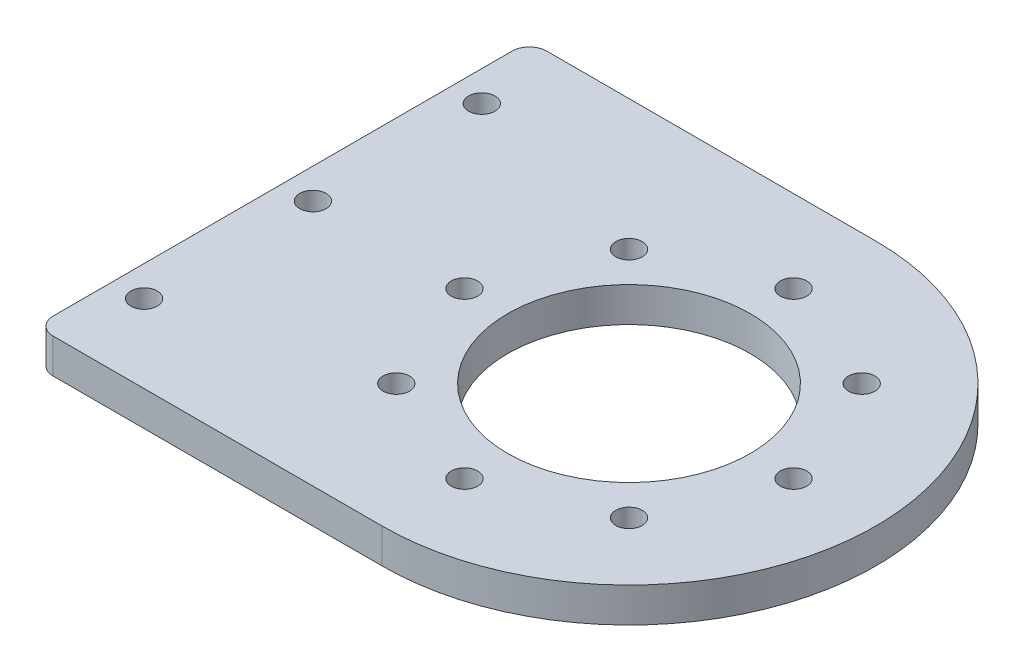
ISO-10303-21;
HEADER;
FILE_DESCRIPTION(('STEP AP214'),'2;1');
FILE_NAME('part.step','',(''),(''),'','','');
FILE_SCHEMA(('AUTOMOTIVE_DESIGN { 1 0 10303 214 1 1 1 1 }'));
ENDSEC;
DATA;
#1=APPLICATION_CONTEXT('core data for automotive mechanical design processes');
#2=APPLICATION_PROTOCOL_DEFINITION('international standard','automotive_design',2000,#1);
#3=PRODUCT_CONTEXT('',#1,'mechanical');
#4=PRODUCT('Part','Part','',(#3));
#5=PRODUCT_RELATED_PRODUCT_CATEGORY('part','',(#4));
#6=PRODUCT_DEFINITION_FORMATION('','',#4);
#7=PRODUCT_DEFINITION_CONTEXT('part definition',#1,'design');
#8=PRODUCT_DEFINITION('design','',#6,#7);
#9=PRODUCT_DEFINITION_SHAPE('','',#8);
#10=(LENGTH_UNIT() NAMED_UNIT(*) SI_UNIT(.MILLI.,.METRE.));
#11=(NAMED_UNIT(*) PLANE_ANGLE_UNIT() SI_UNIT($,.RADIAN.));
#12=(NAMED_UNIT(*) SI_UNIT($,.STERADIAN.) SOLID_ANGLE_UNIT());
#13=UNCERTAINTY_MEASURE_WITH_UNIT(LENGTH_MEASURE(1.E-05),#10,'distance_accuracy_value','');
#14=(GEOMETRIC_REPRESENTATION_CONTEXT(3) GLOBAL_UNCERTAINTY_ASSIGNED_CONTEXT((#13)) GLOBAL_UNIT_ASSIGNED_CONTEXT((#10,
#11,#12)) REPRESENTATION_CONTEXT('',''));
#15=CARTESIAN_POINT('',(0.,0.,0.));
#16=DIRECTION('',(0.,0.,1.));
#17=DIRECTION('',(1.,0.,0.));
#18=AXIS2_PLACEMENT_3D('',#15,#16,#17);
#19=CARTESIAN_POINT('',(0.,4.,28.5));
#20=DIRECTION('',(0.,0.,-1.));
#21=DIRECTION('',(-1.,0.,0.));
#22=AXIS2_PLACEMENT_3D('',#19,#20,#21);
#23=PLANE('',#22);
#24=DIRECTION('',(1.,0.,0.));
#25=VECTOR('',#24,1.);
#26=CARTESIAN_POINT('',(0.,4.,28.5));
#27=LINE('',#26,#25);
#28=CARTESIAN_POINT('',(-18.5,4.,28.5));
#29=VERTEX_POINT('',#28);
#30=CARTESIAN_POINT('',(19.5,4.,28.5));
#31=VERTEX_POINT('',#30);
#32=EDGE_CURVE('E92',#29,#31,#27,.T.);
#33=ORIENTED_EDGE('',*,*,#32,.F.);
#34=DIRECTION('',(0.,1.,0.));
#35=VECTOR('',#34,1.);
#36=CARTESIAN_POINT('',(-18.5,0.,28.5));
#37=LINE('',#36,#35);
#38=CARTESIAN_POINT('',(-18.5,0.,28.5));
#39=VERTEX_POINT('',#38);
#40=EDGE_CURVE('E61',#29,#39,#37,.F.);
#41=ORIENTED_EDGE('',*,*,#40,.T.);
#42=DIRECTION('',(1.,0.,0.));
#43=VECTOR('',#42,1.);
#44=CARTESIAN_POINT('',(0.,0.,28.5));
#45=LINE('',#44,#43);
#46=CARTESIAN_POINT('',(19.5,0.,28.5));
#47=VERTEX_POINT('',#46);
#48=EDGE_CURVE('E112',#39,#47,#45,.T.);
#49=ORIENTED_EDGE('',*,*,#48,.T.);
#50=DIRECTION('',(0.,-1.,0.));
#51=VECTOR('',#50,1.);
#52=CARTESIAN_POINT('',(19.5,4.,28.5));
#53=LINE('',#52,#51);
#54=EDGE_CURVE('E107',#31,#47,#53,.T.);
#55=ORIENTED_EDGE('',*,*,#54,.F.);
#56=EDGE_LOOP('',(#33,#41,#49,#55));
#57=FACE_BOUND('',#56,.T.);
#58=ADVANCED_FACE('F38',(#57),#23,.F.);
#59=CARTESIAN_POINT('',(19.5,4.,0.));
#60=DIRECTION('',(0.,-1.,0.));
#61=DIRECTION('',(0.,0.,-1.));
#62=AXIS2_PLACEMENT_3D('',#59,#60,#61);
#63=CYLINDRICAL_SURFACE('',#62,28.5);
#64=CARTESIAN_POINT('',(19.5,0.,0.));
#65=DIRECTION('',(0.,1.,0.));
#66=DIRECTION('',(0.,0.,1.));
#67=AXIS2_PLACEMENT_3D('',#64,#65,#66);
#68=CIRCLE('',#67,28.5);
#69=CARTESIAN_POINT('',(19.5,0.,-28.5));
#70=VERTEX_POINT('',#69);
#71=EDGE_CURVE('E293',#47,#70,#68,.T.);
#72=ORIENTED_EDGE('',*,*,#71,.T.);
#73=DIRECTION('',(0.,-1.,0.));
#74=VECTOR('',#73,1.);
#75=CARTESIAN_POINT('',(19.5,4.,-28.5));
#76=LINE('',#75,#74);
#77=CARTESIAN_POINT('',(19.5,4.,-28.5));
#78=VERTEX_POINT('',#77);
#79=EDGE_CURVE('E109',#78,#70,#76,.T.);
#80=ORIENTED_EDGE('',*,*,#79,.F.);
#81=CARTESIAN_POINT('',(19.5,4.,0.));
#82=DIRECTION('',(0.,1.,0.));
#83=DIRECTION('',(0.,0.,1.));
#84=AXIS2_PLACEMENT_3D('',#81,#82,#83);
#85=CIRCLE('',#84,28.5);
#86=EDGE_CURVE('E97',#31,#78,#85,.T.);
#87=ORIENTED_EDGE('',*,*,#86,.F.);
#88=ORIENTED_EDGE('',*,*,#54,.T.);
#89=EDGE_LOOP('',(#72,#80,#87,#88));
#90=FACE_BOUND('',#89,.T.);
#91=ADVANCED_FACE('F106',(#90),#63,.T.);
#92=CARTESIAN_POINT('',(0.,4.,-28.5));
#93=DIRECTION('',(0.,0.,-1.));
#94=DIRECTION('',(-1.,0.,0.));
#95=AXIS2_PLACEMENT_3D('',#92,#93,#94);
#96=PLANE('',#95);
#97=DIRECTION('',(1.,0.,0.));
#98=VECTOR('',#97,1.);
#99=CARTESIAN_POINT('',(0.,0.,-28.5));
#100=LINE('',#99,#98);
#101=CARTESIAN_POINT('',(-18.5,0.,-28.5));
#102=VERTEX_POINT('',#101);
#103=EDGE_CURVE('E101',#102,#70,#100,.T.);
#104=ORIENTED_EDGE('',*,*,#103,.F.);
#105=DIRECTION('',(0.,1.,0.));
#106=VECTOR('',#105,1.);
#107=CARTESIAN_POINT('',(-18.5,4.,-28.5));
#108=LINE('',#107,#106);
#109=CARTESIAN_POINT('',(-18.5,4.,-28.5));
#110=VERTEX_POINT('',#109);
#111=EDGE_CURVE('E11',#102,#110,#108,.T.);
#112=ORIENTED_EDGE('',*,*,#111,.T.);
#113=DIRECTION('',(1.,0.,0.));
#114=VECTOR('',#113,1.);
#115=CARTESIAN_POINT('',(0.,4.,-28.5));
#116=LINE('',#115,#114);
#117=EDGE_CURVE('E110',#110,#78,#116,.T.);
#118=ORIENTED_EDGE('',*,*,#117,.T.);
#119=ORIENTED_EDGE('',*,*,#79,.T.);
#120=EDGE_LOOP('',(#104,#112,#118,#119));
#121=FACE_BOUND('',#120,.T.);
#122=ADVANCED_FACE('F154',(#121),#96,.T.);
#123=CARTESIAN_POINT('',(0.,4.,0.));
#124=DIRECTION('',(0.,1.,0.));
#125=DIRECTION('',(0.,0.,1.));
#126=AXIS2_PLACEMENT_3D('',#123,#124,#125);
#127=PLANE('',#126);
#128=CARTESIAN_POINT('',(-17.0000000000104,4.,-19.5));
#129=DIRECTION('',(0.,-1.,0.));
#130=DIRECTION('',(0.,0.,-1.));
#131=AXIS2_PLACEMENT_3D('',#128,#129,#130);
#132=CIRCLE('',#131,1.525);
#133=CARTESIAN_POINT('',(-17.0000000000104,4.,-21.025));
#134=VERTEX_POINT('',#133);
#135=EDGE_CURVE('E222',#134,#134,#132,.T.);
#136=ORIENTED_EDGE('',*,*,#135,.T.);
#137=EDGE_LOOP('',(#136));
#138=FACE_BOUND('',#137,.T.);
#139=CARTESIAN_POINT('',(-17.0000000000104,4.,19.5));
#140=DIRECTION('',(0.,-1.,0.));
#141=DIRECTION('',(0.,0.,-1.));
#142=AXIS2_PLACEMENT_3D('',#139,#140,#141);
#143=CIRCLE('',#142,1.525);
#144=CARTESIAN_POINT('',(-17.0000000000104,4.,17.975));
#145=VERTEX_POINT('',#144);
#146=EDGE_CURVE('E217',#145,#145,#143,.T.);
#147=ORIENTED_EDGE('',*,*,#146,.T.);
#148=EDGE_LOOP('',(#147));
#149=FACE_BOUND('',#148,.T.);
#150=CARTESIAN_POINT('',(-17.0000000000104,4.,0.));
#151=DIRECTION('',(0.,-1.,0.));
#152=DIRECTION('',(0.,0.,-1.));
#153=AXIS2_PLACEMENT_3D('',#150,#151,#152);
#154=CIRCLE('',#153,1.525);
#155=CARTESIAN_POINT('',(-17.0000000000104,4.,-1.52499999999997));
#156=VERTEX_POINT('',#155);
#157=EDGE_CURVE('E232',#156,#156,#154,.T.);
#158=ORIENTED_EDGE('',*,*,#157,.T.);
#159=EDGE_LOOP('',(#158));
#160=FACE_BOUND('',#159,.T.);
#161=CARTESIAN_POINT('',(19.5,4.,0.));
#162=DIRECTION('',(0.,1.,0.));
#163=DIRECTION('',(0.,0.,1.));
#164=AXIS2_PLACEMENT_3D('',#161,#162,#163);
#165=CIRCLE('',#164,14.);
#166=CARTESIAN_POINT('',(19.5,4.,14.));
#167=VERTEX_POINT('',#166);
#168=EDGE_CURVE('E235',#167,#167,#165,.T.);
#169=ORIENTED_EDGE('',*,*,#168,.F.);
#170=EDGE_LOOP('',(#169));
#171=FACE_BOUND('',#170,.T.);
#172=CARTESIAN_POINT('',(38.5,4.,0.));
#173=DIRECTION('',(0.,1.,0.));
#174=DIRECTION('',(0.,0.,1.));
#175=AXIS2_PLACEMENT_3D('',#172,#173,#174);
#176=CIRCLE('',#175,1.525);
#177=CARTESIAN_POINT('',(38.5,4.,1.525));
#178=VERTEX_POINT('',#177);
#179=EDGE_CURVE('E266',#178,#178,#176,.T.);
#180=ORIENTED_EDGE('',*,*,#179,.F.);
#181=EDGE_LOOP('',(#180));
#182=FACE_BOUND('',#181,.T.);
#183=CARTESIAN_POINT('',(32.9350288425443,4.,13.4350288425445));
#184=DIRECTION('',(0.,1.,0.));
#185=DIRECTION('',(0.,0.,1.));
#186=AXIS2_PLACEMENT_3D('',#183,#184,#185);
#187=CIRCLE('',#186,1.525);
#188=CARTESIAN_POINT('',(32.9350288425443,4.,14.9600288425445));
#189=VERTEX_POINT('',#188);
#190=EDGE_CURVE('E272',#189,#189,#187,.T.);
#191=ORIENTED_EDGE('',*,*,#190,.F.);
#192=EDGE_LOOP('',(#191));
#193=FACE_BOUND('',#192,.T.);
#194=CARTESIAN_POINT('',(6.06497115745552,4.,13.4350288425443));
#195=DIRECTION('',(0.,1.,0.));
#196=DIRECTION('',(0.,0.,1.));
#197=AXIS2_PLACEMENT_3D('',#194,#195,#196);
#198=CIRCLE('',#197,1.525);
#199=CARTESIAN_POINT('',(6.06497115745552,4.,14.9600288425443));
#200=VERTEX_POINT('',#199);
#201=EDGE_CURVE('E278',#200,#200,#198,.T.);
#202=ORIENTED_EDGE('',*,*,#201,.F.);
#203=EDGE_LOOP('',(#202));
#204=FACE_BOUND('',#203,.T.);
#205=CARTESIAN_POINT('',(6.06497115745565,4.,-13.4350288425445));
#206=DIRECTION('',(0.,1.,0.));
#207=DIRECTION('',(0.,0.,1.));
#208=AXIS2_PLACEMENT_3D('',#205,#206,#207);
#209=CIRCLE('',#208,1.525);
#210=CARTESIAN_POINT('',(6.06497115745565,4.,-11.9100288425445));
#211=VERTEX_POINT('',#210);
#212=EDGE_CURVE('E247',#211,#211,#209,.T.);
#213=ORIENTED_EDGE('',*,*,#212,.F.);
#214=EDGE_LOOP('',(#213));
#215=FACE_BOUND('',#214,.T.);
#216=CARTESIAN_POINT('',(19.4999999999999,4.,19.));
#217=DIRECTION('',(0.,1.,0.));
#218=DIRECTION('',(0.,0.,1.));
#219=AXIS2_PLACEMENT_3D('',#216,#217,#218);
#220=CIRCLE('',#219,1.52499999999999);
#221=CARTESIAN_POINT('',(19.4999999999999,4.,20.525));
#222=VERTEX_POINT('',#221);
#223=EDGE_CURVE('E248',#222,#222,#220,.T.);
#224=ORIENTED_EDGE('',*,*,#223,.F.);
#225=EDGE_LOOP('',(#224));
#226=FACE_BOUND('',#225,.T.);
#227=CARTESIAN_POINT('',(0.499999999999987,4.,-1.37329948712799E-13));
#228=DIRECTION('',(0.,1.,0.));
#229=DIRECTION('',(0.,0.,1.));
#230=AXIS2_PLACEMENT_3D('',#227,#228,#229);
#231=CIRCLE('',#230,1.52499999999999);
#232=CARTESIAN_POINT('',(0.499999999999987,4.,1.52499999999986));
#233=VERTEX_POINT('',#232);
#234=EDGE_CURVE('E254',#233,#233,#231,.T.);
#235=ORIENTED_EDGE('',*,*,#234,.F.);
#236=EDGE_LOOP('',(#235));
#237=FACE_BOUND('',#236,.T.);
#238=CARTESIAN_POINT('',(19.5000000000002,4.,-19.));
#239=DIRECTION('',(0.,1.,0.));
#240=DIRECTION('',(0.,0.,1.));
#241=AXIS2_PLACEMENT_3D('',#238,#239,#240);
#242=CIRCLE('',#241,1.525);
#243=CARTESIAN_POINT('',(19.5000000000002,4.,-17.475));
#244=VERTEX_POINT('',#243);
#245=EDGE_CURVE('E241',#244,#244,#242,.T.);
#246=ORIENTED_EDGE('',*,*,#245,.F.);
#247=EDGE_LOOP('',(#246));
#248=FACE_BOUND('',#247,.T.);
#249=CARTESIAN_POINT('',(32.9350288425445,4.,-13.4350288425443));
#250=DIRECTION('',(0.,1.,0.));
#251=DIRECTION('',(0.,0.,1.));
#252=AXIS2_PLACEMENT_3D('',#249,#250,#251);
#253=CIRCLE('',#252,1.525);
#254=CARTESIAN_POINT('',(32.9350288425445,4.,-11.9100288425443));
#255=VERTEX_POINT('',#254);
#256=EDGE_CURVE('E265',#255,#255,#253,.T.);
#257=ORIENTED_EDGE('',*,*,#256,.F.);
#258=EDGE_LOOP('',(#257));
#259=FACE_BOUND('',#258,.T.);
#260=DIRECTION('',(0.,0.,1.));
#261=VECTOR('',#260,1.);
#262=CARTESIAN_POINT('',(-20.5,4.,-28.5));
#263=LINE('',#262,#261);
#264=CARTESIAN_POINT('',(-20.5,4.,-26.5));
#265=VERTEX_POINT('',#264);
#266=CARTESIAN_POINT('',(-20.5,4.,26.5));
#267=VERTEX_POINT('',#266);
#268=EDGE_CURVE('E138',#265,#267,#263,.T.);
#269=ORIENTED_EDGE('',*,*,#268,.T.);
#270=CARTESIAN_POINT('',(-18.5,4.,26.5));
#271=DIRECTION('',(0.,1.,0.));
#272=DIRECTION('',(0.,0.,1.));
#273=AXIS2_PLACEMENT_3D('',#270,#271,#272);
#274=CIRCLE('',#273,2.);
#275=EDGE_CURVE('E99',#267,#29,#274,.T.);
#276=ORIENTED_EDGE('',*,*,#275,.T.);
#277=ORIENTED_EDGE('',*,*,#32,.T.);
#278=ORIENTED_EDGE('',*,*,#86,.T.);
#279=ORIENTED_EDGE('',*,*,#117,.F.);
#280=CARTESIAN_POINT('',(-18.5,4.,-26.5));
#281=DIRECTION('',(0.,1.,0.));
#282=DIRECTION('',(0.,0.,1.));
#283=AXIS2_PLACEMENT_3D('',#280,#281,#282);
#284=CIRCLE('',#283,2.);
#285=EDGE_CURVE('E123',#110,#265,#284,.T.);
#286=ORIENTED_EDGE('',*,*,#285,.T.);
#287=EDGE_LOOP('',(#269,#276,#277,#278,#279,#286));
#288=FACE_BOUND('',#287,.T.);
#289=ADVANCED_FACE('F95',(#138,#149,#160,#171,#182,#193,#204,#215,#226,#237,#248,#259,#288),
#127,.T.);
#290=CARTESIAN_POINT('',(0.,0.,0.));
#291=DIRECTION('',(0.,1.,0.));
#292=DIRECTION('',(0.,0.,1.));
#293=AXIS2_PLACEMENT_3D('',#290,#291,#292);
#294=PLANE('',#293);
#295=CARTESIAN_POINT('',(-17.0000000000104,0.,-19.5));
#296=DIRECTION('',(0.,-1.,0.));
#297=DIRECTION('',(0.,0.,-1.));
#298=AXIS2_PLACEMENT_3D('',#295,#296,#297);
#299=CIRCLE('',#298,1.525);
#300=CARTESIAN_POINT('',(-17.0000000000104,0.,-21.025));
#301=VERTEX_POINT('',#300);
#302=EDGE_CURVE('E137',#301,#301,#299,.T.);
#303=ORIENTED_EDGE('',*,*,#302,.F.);
#304=EDGE_LOOP('',(#303));
#305=FACE_BOUND('',#304,.T.);
#306=CARTESIAN_POINT('',(-17.0000000000104,0.,19.5));
#307=DIRECTION('',(0.,-1.,0.));
#308=DIRECTION('',(0.,0.,-1.));
#309=AXIS2_PLACEMENT_3D('',#306,#307,#308);
#310=CIRCLE('',#309,1.525);
#311=CARTESIAN_POINT('',(-17.0000000000104,0.,17.975));
#312=VERTEX_POINT('',#311);
#313=EDGE_CURVE('E220',#312,#312,#310,.T.);
#314=ORIENTED_EDGE('',*,*,#313,.F.);
#315=EDGE_LOOP('',(#314));
#316=FACE_BOUND('',#315,.T.);
#317=CARTESIAN_POINT('',(-17.0000000000104,0.,0.));
#318=DIRECTION('',(0.,-1.,0.));
#319=DIRECTION('',(0.,0.,-1.));
#320=AXIS2_PLACEMENT_3D('',#317,#318,#319);
#321=CIRCLE('',#320,1.525);
#322=CARTESIAN_POINT('',(-17.0000000000104,0.,-1.52499999999997));
#323=VERTEX_POINT('',#322);
#324=EDGE_CURVE('E224',#323,#323,#321,.T.);
#325=ORIENTED_EDGE('',*,*,#324,.F.);
#326=EDGE_LOOP('',(#325));
#327=FACE_BOUND('',#326,.T.);
#328=CARTESIAN_POINT('',(19.5,0.,0.));
#329=DIRECTION('',(0.,1.,0.));
#330=DIRECTION('',(0.,0.,1.));
#331=AXIS2_PLACEMENT_3D('',#328,#329,#330);
#332=CIRCLE('',#331,14.);
#333=CARTESIAN_POINT('',(19.5,0.,14.));
#334=VERTEX_POINT('',#333);
#335=EDGE_CURVE('E238',#334,#334,#332,.T.);
#336=ORIENTED_EDGE('',*,*,#335,.T.);
#337=EDGE_LOOP('',(#336));
#338=FACE_BOUND('',#337,.T.);
#339=CARTESIAN_POINT('',(38.5,0.,0.));
#340=DIRECTION('',(0.,1.,0.));
#341=DIRECTION('',(0.,0.,1.));
#342=AXIS2_PLACEMENT_3D('',#339,#340,#341);
#343=CIRCLE('',#342,1.525);
#344=CARTESIAN_POINT('',(38.5,0.,1.525));
#345=VERTEX_POINT('',#344);
#346=EDGE_CURVE('E262',#345,#345,#343,.T.);
#347=ORIENTED_EDGE('',*,*,#346,.T.);
#348=EDGE_LOOP('',(#347));
#349=FACE_BOUND('',#348,.T.);
#350=CARTESIAN_POINT('',(32.9350288425443,0.,13.4350288425445));
#351=DIRECTION('',(0.,1.,0.));
#352=DIRECTION('',(0.,0.,1.));
#353=AXIS2_PLACEMENT_3D('',#350,#351,#352);
#354=CIRCLE('',#353,1.525);
#355=CARTESIAN_POINT('',(32.9350288425443,0.,14.9600288425445));
#356=VERTEX_POINT('',#355);
#357=EDGE_CURVE('E269',#356,#356,#354,.T.);
#358=ORIENTED_EDGE('',*,*,#357,.T.);
#359=EDGE_LOOP('',(#358));
#360=FACE_BOUND('',#359,.T.);
#361=CARTESIAN_POINT('',(6.06497115745552,0.,13.4350288425443));
#362=DIRECTION('',(0.,1.,0.));
#363=DIRECTION('',(0.,0.,1.));
#364=AXIS2_PLACEMENT_3D('',#361,#362,#363);
#365=CIRCLE('',#364,1.525);
#366=CARTESIAN_POINT('',(6.06497115745552,0.,14.9600288425443));
#367=VERTEX_POINT('',#366);
#368=EDGE_CURVE('E275',#367,#367,#365,.T.);
#369=ORIENTED_EDGE('',*,*,#368,.T.);
#370=EDGE_LOOP('',(#369));
#371=FACE_BOUND('',#370,.T.);
#372=CARTESIAN_POINT('',(6.06497115745565,0.,-13.4350288425445));
#373=DIRECTION('',(0.,1.,0.));
#374=DIRECTION('',(0.,0.,1.));
#375=AXIS2_PLACEMENT_3D('',#372,#373,#374);
#376=CIRCLE('',#375,1.525);
#377=CARTESIAN_POINT('',(6.06497115745565,0.,-11.9100288425445));
#378=VERTEX_POINT('',#377);
#379=EDGE_CURVE('E281',#378,#378,#376,.T.);
#380=ORIENTED_EDGE('',*,*,#379,.T.);
#381=EDGE_LOOP('',(#380));
#382=FACE_BOUND('',#381,.T.);
#383=CARTESIAN_POINT('',(19.4999999999999,0.,19.));
#384=DIRECTION('',(0.,1.,0.));
#385=DIRECTION('',(0.,0.,1.));
#386=AXIS2_PLACEMENT_3D('',#383,#384,#385);
#387=CIRCLE('',#386,1.52499999999999);
#388=CARTESIAN_POINT('',(19.4999999999999,0.,20.525));
#389=VERTEX_POINT('',#388);
#390=EDGE_CURVE('E244',#389,#389,#387,.T.);
#391=ORIENTED_EDGE('',*,*,#390,.T.);
#392=EDGE_LOOP('',(#391));
#393=FACE_BOUND('',#392,.T.);
#394=CARTESIAN_POINT('',(0.499999999999987,0.,-1.37329948712799E-13));
#395=DIRECTION('',(0.,1.,0.));
#396=DIRECTION('',(0.,0.,1.));
#397=AXIS2_PLACEMENT_3D('',#394,#395,#396);
#398=CIRCLE('',#397,1.52499999999999);
#399=CARTESIAN_POINT('',(0.499999999999987,0.,1.52499999999986));
#400=VERTEX_POINT('',#399);
#401=EDGE_CURVE('E251',#400,#400,#398,.T.);
#402=ORIENTED_EDGE('',*,*,#401,.T.);
#403=EDGE_LOOP('',(#402));
#404=FACE_BOUND('',#403,.T.);
#405=CARTESIAN_POINT('',(19.5000000000002,0.,-19.));
#406=DIRECTION('',(0.,1.,0.));
#407=DIRECTION('',(0.,0.,1.));
#408=AXIS2_PLACEMENT_3D('',#405,#406,#407);
#409=CIRCLE('',#408,1.525);
#410=CARTESIAN_POINT('',(19.5000000000002,0.,-17.475));
#411=VERTEX_POINT('',#410);
#412=EDGE_CURVE('E257',#411,#411,#409,.T.);
#413=ORIENTED_EDGE('',*,*,#412,.T.);
#414=EDGE_LOOP('',(#413));
#415=FACE_BOUND('',#414,.T.);
#416=CARTESIAN_POINT('',(32.9350288425445,0.,-13.4350288425443));
#417=DIRECTION('',(0.,1.,0.));
#418=DIRECTION('',(0.,0.,1.));
#419=AXIS2_PLACEMENT_3D('',#416,#417,#418);
#420=CIRCLE('',#419,1.525);
#421=CARTESIAN_POINT('',(32.9350288425445,0.,-11.9100288425443));
#422=VERTEX_POINT('',#421);
#423=EDGE_CURVE('E286',#422,#422,#420,.T.);
#424=ORIENTED_EDGE('',*,*,#423,.T.);
#425=EDGE_LOOP('',(#424));
#426=FACE_BOUND('',#425,.T.);
#427=ORIENTED_EDGE('',*,*,#48,.F.);
#428=CARTESIAN_POINT('',(-18.5,0.,26.5));
#429=DIRECTION('',(0.,1.,0.));
#430=DIRECTION('',(0.,0.,1.));
#431=AXIS2_PLACEMENT_3D('',#428,#429,#430);
#432=CIRCLE('',#431,2.);
#433=CARTESIAN_POINT('',(-20.5,0.,26.5));
#434=VERTEX_POINT('',#433);
#435=EDGE_CURVE('E46',#39,#434,#432,.F.);
#436=ORIENTED_EDGE('',*,*,#435,.T.);
#437=DIRECTION('',(0.,0.,-1.));
#438=VECTOR('',#437,1.);
#439=CARTESIAN_POINT('',(-20.5,0.,-28.5));
#440=LINE('',#439,#438);
#441=CARTESIAN_POINT('',(-20.5,0.,-26.5));
#442=VERTEX_POINT('',#441);
#443=EDGE_CURVE('E130',#434,#442,#440,.T.);
#444=ORIENTED_EDGE('',*,*,#443,.T.);
#445=CARTESIAN_POINT('',(-18.5,0.,-26.5));
#446=DIRECTION('',(0.,1.,0.));
#447=DIRECTION('',(0.,0.,1.));
#448=AXIS2_PLACEMENT_3D('',#445,#446,#447);
#449=CIRCLE('',#448,2.);
#450=EDGE_CURVE('E53',#442,#102,#449,.F.);
#451=ORIENTED_EDGE('',*,*,#450,.T.);
#452=ORIENTED_EDGE('',*,*,#103,.T.);
#453=ORIENTED_EDGE('',*,*,#71,.F.);
#454=EDGE_LOOP('',(#427,#436,#444,#451,#452,#453));
#455=FACE_BOUND('',#454,.T.);
#456=ADVANCED_FACE('F129',(#305,#316,#327,#338,#349,#360,#371,#382,#393,#404,#415,#426,#455),
#294,.F.);
#457=CARTESIAN_POINT('',(32.9350288425445,0.,-13.4350288425443));
#458=DIRECTION('',(0.,1.,0.));
#459=DIRECTION('',(0.,0.,1.));
#460=AXIS2_PLACEMENT_3D('',#457,#458,#459);
#461=CYLINDRICAL_SURFACE('',#460,1.525);
#462=ORIENTED_EDGE('',*,*,#423,.F.);
#463=EDGE_LOOP('',(#462));
#464=FACE_BOUND('',#463,.T.);
#465=ORIENTED_EDGE('',*,*,#256,.T.);
#466=EDGE_LOOP('',(#465));
#467=FACE_BOUND('',#466,.T.);
#468=ADVANCED_FACE('F162',(#464,#467),#461,.F.);
#469=CARTESIAN_POINT('',(19.5000000000002,0.,-19.));
#470=DIRECTION('',(0.,1.,0.));
#471=DIRECTION('',(0.,0.,1.));
#472=AXIS2_PLACEMENT_3D('',#469,#470,#471);
#473=CYLINDRICAL_SURFACE('',#472,1.525);
#474=ORIENTED_EDGE('',*,*,#412,.F.);
#475=EDGE_LOOP('',(#474));
#476=FACE_BOUND('',#475,.T.);
#477=ORIENTED_EDGE('',*,*,#245,.T.);
#478=EDGE_LOOP('',(#477));
#479=FACE_BOUND('',#478,.T.);
#480=ADVANCED_FACE('F169',(#476,#479),#473,.F.);
#481=CARTESIAN_POINT('',(0.499999999999987,0.,-1.37329948712799E-13));
#482=DIRECTION('',(0.,1.,0.));
#483=DIRECTION('',(0.,0.,1.));
#484=AXIS2_PLACEMENT_3D('',#481,#482,#483);
#485=CYLINDRICAL_SURFACE('',#484,1.52499999999999);
#486=ORIENTED_EDGE('',*,*,#401,.F.);
#487=EDGE_LOOP('',(#486));
#488=FACE_BOUND('',#487,.T.);
#489=ORIENTED_EDGE('',*,*,#234,.T.);
#490=EDGE_LOOP('',(#489));
#491=FACE_BOUND('',#490,.T.);
#492=ADVANCED_FACE('F191',(#488,#491),#485,.F.);
#493=CARTESIAN_POINT('',(19.4999999999999,0.,19.));
#494=DIRECTION('',(0.,1.,0.));
#495=DIRECTION('',(0.,0.,1.));
#496=AXIS2_PLACEMENT_3D('',#493,#494,#495);
#497=CYLINDRICAL_SURFACE('',#496,1.52499999999999);
#498=ORIENTED_EDGE('',*,*,#390,.F.);
#499=EDGE_LOOP('',(#498));
#500=FACE_BOUND('',#499,.T.);
#501=ORIENTED_EDGE('',*,*,#223,.T.);
#502=EDGE_LOOP('',(#501));
#503=FACE_BOUND('',#502,.T.);
#504=ADVANCED_FACE('F175',(#500,#503),#497,.F.);
#505=CARTESIAN_POINT('',(6.06497115745565,0.,-13.4350288425445));
#506=DIRECTION('',(0.,1.,0.));
#507=DIRECTION('',(0.,0.,1.));
#508=AXIS2_PLACEMENT_3D('',#505,#506,#507);
#509=CYLINDRICAL_SURFACE('',#508,1.525);
#510=ORIENTED_EDGE('',*,*,#379,.F.);
#511=EDGE_LOOP('',(#510));
#512=FACE_BOUND('',#511,.T.);
#513=ORIENTED_EDGE('',*,*,#212,.T.);
#514=EDGE_LOOP('',(#513));
#515=FACE_BOUND('',#514,.T.);
#516=ADVANCED_FACE('F171',(#512,#515),#509,.F.);
#517=CARTESIAN_POINT('',(6.06497115745552,0.,13.4350288425443));
#518=DIRECTION('',(0.,1.,0.));
#519=DIRECTION('',(0.,0.,1.));
#520=AXIS2_PLACEMENT_3D('',#517,#518,#519);
#521=CYLINDRICAL_SURFACE('',#520,1.525);
#522=ORIENTED_EDGE('',*,*,#368,.F.);
#523=EDGE_LOOP('',(#522));
#524=FACE_BOUND('',#523,.T.);
#525=ORIENTED_EDGE('',*,*,#201,.T.);
#526=EDGE_LOOP('',(#525));
#527=FACE_BOUND('',#526,.T.);
#528=ADVANCED_FACE('F174',(#524,#527),#521,.F.);
#529=CARTESIAN_POINT('',(32.9350288425443,0.,13.4350288425445));
#530=DIRECTION('',(0.,1.,0.));
#531=DIRECTION('',(0.,0.,1.));
#532=AXIS2_PLACEMENT_3D('',#529,#530,#531);
#533=CYLINDRICAL_SURFACE('',#532,1.525);
#534=ORIENTED_EDGE('',*,*,#357,.F.);
#535=EDGE_LOOP('',(#534));
#536=FACE_BOUND('',#535,.T.);
#537=ORIENTED_EDGE('',*,*,#190,.T.);
#538=EDGE_LOOP('',(#537));
#539=FACE_BOUND('',#538,.T.);
#540=ADVANCED_FACE('F179',(#536,#539),#533,.F.);
#541=CARTESIAN_POINT('',(38.5,0.,0.));
#542=DIRECTION('',(0.,1.,0.));
#543=DIRECTION('',(0.,0.,1.));
#544=AXIS2_PLACEMENT_3D('',#541,#542,#543);
#545=CYLINDRICAL_SURFACE('',#544,1.525);
#546=ORIENTED_EDGE('',*,*,#346,.F.);
#547=EDGE_LOOP('',(#546));
#548=FACE_BOUND('',#547,.T.);
#549=ORIENTED_EDGE('',*,*,#179,.T.);
#550=EDGE_LOOP('',(#549));
#551=FACE_BOUND('',#550,.T.);
#552=ADVANCED_FACE('F183',(#548,#551),#545,.F.);
#553=CARTESIAN_POINT('',(19.5,0.,0.));
#554=DIRECTION('',(0.,1.,0.));
#555=DIRECTION('',(0.,0.,1.));
#556=AXIS2_PLACEMENT_3D('',#553,#554,#555);
#557=CYLINDRICAL_SURFACE('',#556,14.);
#558=ORIENTED_EDGE('',*,*,#335,.F.);
#559=EDGE_LOOP('',(#558));
#560=FACE_BOUND('',#559,.T.);
#561=ORIENTED_EDGE('',*,*,#168,.T.);
#562=EDGE_LOOP('',(#561));
#563=FACE_BOUND('',#562,.T.);
#564=ADVANCED_FACE('F187',(#560,#563),#557,.F.);
#565=CARTESIAN_POINT('',(-17.0000000000104,4.,0.));
#566=DIRECTION('',(0.,-1.,0.));
#567=DIRECTION('',(0.,0.,-1.));
#568=AXIS2_PLACEMENT_3D('',#565,#566,#567);
#569=CYLINDRICAL_SURFACE('',#568,1.525);
#570=ORIENTED_EDGE('',*,*,#157,.F.);
#571=EDGE_LOOP('',(#570));
#572=FACE_BOUND('',#571,.T.);
#573=ORIENTED_EDGE('',*,*,#324,.T.);
#574=EDGE_LOOP('',(#573));
#575=FACE_BOUND('',#574,.T.);
#576=ADVANCED_FACE('F201',(#572,#575),#569,.F.);
#577=CARTESIAN_POINT('',(-17.0000000000104,4.,19.5));
#578=DIRECTION('',(0.,-1.,0.));
#579=DIRECTION('',(0.,0.,-1.));
#580=AXIS2_PLACEMENT_3D('',#577,#578,#579);
#581=CYLINDRICAL_SURFACE('',#580,1.525);
#582=ORIENTED_EDGE('',*,*,#146,.F.);
#583=EDGE_LOOP('',(#582));
#584=FACE_BOUND('',#583,.T.);
#585=ORIENTED_EDGE('',*,*,#313,.T.);
#586=EDGE_LOOP('',(#585));
#587=FACE_BOUND('',#586,.T.);
#588=ADVANCED_FACE('F205',(#584,#587),#581,.F.);
#589=CARTESIAN_POINT('',(-17.0000000000104,4.,-19.5));
#590=DIRECTION('',(0.,-1.,0.));
#591=DIRECTION('',(0.,0.,-1.));
#592=AXIS2_PLACEMENT_3D('',#589,#590,#591);
#593=CYLINDRICAL_SURFACE('',#592,1.525);
#594=ORIENTED_EDGE('',*,*,#135,.F.);
#595=EDGE_LOOP('',(#594));
#596=FACE_BOUND('',#595,.T.);
#597=ORIENTED_EDGE('',*,*,#302,.T.);
#598=EDGE_LOOP('',(#597));
#599=FACE_BOUND('',#598,.T.);
#600=ADVANCED_FACE('F147',(#596,#599),#593,.F.);
#601=CARTESIAN_POINT('',(-20.5,-57.0087712549569,-28.5));
#602=DIRECTION('',(-1.,0.,0.));
#603=DIRECTION('',(0.,0.,1.));
#604=AXIS2_PLACEMENT_3D('',#601,#602,#603);
#605=PLANE('',#604);
#606=ORIENTED_EDGE('',*,*,#443,.F.);
#607=DIRECTION('',(0.,1.,0.));
#608=VECTOR('',#607,1.);
#609=CARTESIAN_POINT('',(-20.5,4.,26.5));
#610=LINE('',#609,#608);
#611=EDGE_CURVE('E116',#434,#267,#610,.T.);
#612=ORIENTED_EDGE('',*,*,#611,.T.);
#613=ORIENTED_EDGE('',*,*,#268,.F.);
#614=DIRECTION('',(0.,1.,0.));
#615=VECTOR('',#614,1.);
#616=CARTESIAN_POINT('',(-20.5,-57.0087712549569,-26.5));
#617=LINE('',#616,#615);
#618=EDGE_CURVE('E114',#265,#442,#617,.F.);
#619=ORIENTED_EDGE('',*,*,#618,.T.);
#620=EDGE_LOOP('',(#606,#612,#613,#619));
#621=FACE_BOUND('',#620,.T.);
#622=ADVANCED_FACE('F134',(#621),#605,.T.);
#623=CARTESIAN_POINT('',(-18.5,-57.0087712549569,26.5));
#624=DIRECTION('',(0.,-1.,0.));
#625=DIRECTION('',(0.,0.,-1.));
#626=AXIS2_PLACEMENT_3D('',#623,#624,#625);
#627=CYLINDRICAL_SURFACE('',#626,2.);
#628=ORIENTED_EDGE('',*,*,#435,.F.);
#629=ORIENTED_EDGE('',*,*,#40,.F.);
#630=ORIENTED_EDGE('',*,*,#275,.F.);
#631=ORIENTED_EDGE('',*,*,#611,.F.);
#632=EDGE_LOOP('',(#628,#629,#630,#631));
#633=FACE_BOUND('',#632,.T.);
#634=ADVANCED_FACE('F140',(#633),#627,.T.);
#635=CARTESIAN_POINT('',(-18.5,4.,-26.5));
#636=DIRECTION('',(0.,1.,0.));
#637=DIRECTION('',(0.,0.,1.));
#638=AXIS2_PLACEMENT_3D('',#635,#636,#637);
#639=CYLINDRICAL_SURFACE('',#638,2.);
#640=ORIENTED_EDGE('',*,*,#450,.F.);
#641=ORIENTED_EDGE('',*,*,#618,.F.);
#642=ORIENTED_EDGE('',*,*,#285,.F.);
#643=ORIENTED_EDGE('',*,*,#111,.F.);
#644=EDGE_LOOP('',(#640,#641,#642,#643));
#645=FACE_BOUND('',#644,.T.);
#646=ADVANCED_FACE('F40',(#645),#639,.T.);
#647=CLOSED_SHELL('',(#58,#91,#122,#289,#456,#468,#480,#492,#504,#516,#528,#540,#552,#564,#576,
#588,#600,#622,#634,#646));
#648=MANIFOLD_SOLID_BREP('B2',#647);
#649=ADVANCED_BREP_SHAPE_REPRESENTATION('',(#18,#648),#14);
#650=SHAPE_DEFINITION_REPRESENTATION(#9,#649);
ENDSEC;
END-ISO-10303-21;
